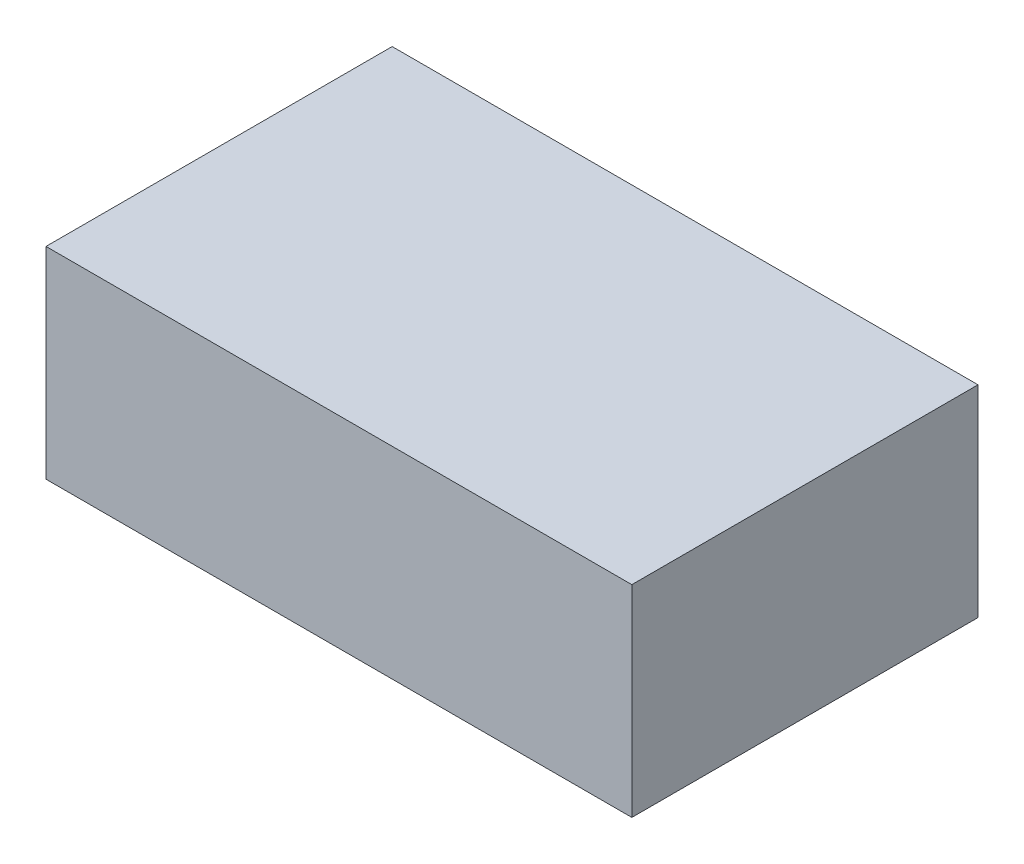
ISO-10303-21;
HEADER;
FILE_DESCRIPTION(('STEP AP214'),'2;1');
FILE_NAME('part.step','',(''),(''),'','','');
FILE_SCHEMA(('AUTOMOTIVE_DESIGN { 1 0 10303 214 1 1 1 1 }'));
ENDSEC;
DATA;
#1=APPLICATION_CONTEXT('core data for automotive mechanical design processes');
#2=APPLICATION_PROTOCOL_DEFINITION('international standard','automotive_design',2000,#1);
#3=PRODUCT_CONTEXT('',#1,'mechanical');
#4=PRODUCT('Part','Part','',(#3));
#5=PRODUCT_RELATED_PRODUCT_CATEGORY('part','',(#4));
#6=PRODUCT_DEFINITION_FORMATION('','',#4);
#7=PRODUCT_DEFINITION_CONTEXT('part definition',#1,'design');
#8=PRODUCT_DEFINITION('design','',#6,#7);
#9=PRODUCT_DEFINITION_SHAPE('','',#8);
#10=(LENGTH_UNIT() NAMED_UNIT(*) SI_UNIT(.MILLI.,.METRE.));
#11=(NAMED_UNIT(*) PLANE_ANGLE_UNIT() SI_UNIT($,.RADIAN.));
#12=(NAMED_UNIT(*) SI_UNIT($,.STERADIAN.) SOLID_ANGLE_UNIT());
#13=UNCERTAINTY_MEASURE_WITH_UNIT(LENGTH_MEASURE(1.E-05),#10,'distance_accuracy_value','');
#14=(GEOMETRIC_REPRESENTATION_CONTEXT(3) GLOBAL_UNCERTAINTY_ASSIGNED_CONTEXT((#13)) GLOBAL_UNIT_ASSIGNED_CONTEXT((#10,
#11,#12)) REPRESENTATION_CONTEXT('',''));
#15=CARTESIAN_POINT('',(0.,0.,0.));
#16=DIRECTION('',(0.,0.,1.));
#17=DIRECTION('',(1.,0.,0.));
#18=AXIS2_PLACEMENT_3D('',#15,#16,#17);
#19=CARTESIAN_POINT('',(77.,53.,45.5));
#20=DIRECTION('',(-1.,0.,0.));
#21=DIRECTION('',(0.,0.,1.));
#22=AXIS2_PLACEMENT_3D('',#19,#20,#21);
#23=PLANE('',#22);
#24=DIRECTION('',(0.,0.,-1.));
#25=VECTOR('',#24,1.);
#26=CARTESIAN_POINT('',(77.,0.,45.5));
#27=LINE('',#26,#25);
#28=CARTESIAN_POINT('',(77.,0.,45.5));
#29=VERTEX_POINT('',#28);
#30=CARTESIAN_POINT('',(77.,0.,-45.5));
#31=VERTEX_POINT('',#30);
#32=EDGE_CURVE('E98',#29,#31,#27,.T.);
#33=ORIENTED_EDGE('',*,*,#32,.T.);
#34=DIRECTION('',(0.,-1.,0.));
#35=VECTOR('',#34,1.);
#36=CARTESIAN_POINT('',(77.,53.,-45.5));
#37=LINE('',#36,#35);
#38=CARTESIAN_POINT('',(77.,53.,-45.5));
#39=VERTEX_POINT('',#38);
#40=EDGE_CURVE('E11',#39,#31,#37,.T.);
#41=ORIENTED_EDGE('',*,*,#40,.F.);
#42=DIRECTION('',(0.,0.,-1.));
#43=VECTOR('',#42,1.);
#44=CARTESIAN_POINT('',(77.,53.,45.5));
#45=LINE('',#44,#43);
#46=CARTESIAN_POINT('',(77.,53.,45.5));
#47=VERTEX_POINT('',#46);
#48=EDGE_CURVE('E86',#47,#39,#45,.T.);
#49=ORIENTED_EDGE('',*,*,#48,.F.);
#50=DIRECTION('',(0.,-1.,0.));
#51=VECTOR('',#50,1.);
#52=CARTESIAN_POINT('',(77.,53.,45.5));
#53=LINE('',#52,#51);
#54=EDGE_CURVE('E94',#47,#29,#53,.T.);
#55=ORIENTED_EDGE('',*,*,#54,.T.);
#56=EDGE_LOOP('',(#33,#41,#49,#55));
#57=FACE_BOUND('',#56,.T.);
#58=ADVANCED_FACE('F35',(#57),#23,.F.);
#59=CARTESIAN_POINT('',(-77.,53.,-45.5));
#60=DIRECTION('',(0.,0.,1.));
#61=DIRECTION('',(1.,0.,0.));
#62=AXIS2_PLACEMENT_3D('',#59,#60,#61);
#63=PLANE('',#62);
#64=DIRECTION('',(-1.,0.,0.));
#65=VECTOR('',#64,1.);
#66=CARTESIAN_POINT('',(-77.,0.,-45.5));
#67=LINE('',#66,#65);
#68=CARTESIAN_POINT('',(-77.,0.,-45.5));
#69=VERTEX_POINT('',#68);
#70=EDGE_CURVE('E90',#31,#69,#67,.T.);
#71=ORIENTED_EDGE('',*,*,#70,.T.);
#72=DIRECTION('',(0.,-1.,0.));
#73=VECTOR('',#72,1.);
#74=CARTESIAN_POINT('',(-77.,53.,-45.5));
#75=LINE('',#74,#73);
#76=CARTESIAN_POINT('',(-77.,53.,-45.5));
#77=VERTEX_POINT('',#76);
#78=EDGE_CURVE('E43',#77,#69,#75,.T.);
#79=ORIENTED_EDGE('',*,*,#78,.F.);
#80=DIRECTION('',(-1.,0.,0.));
#81=VECTOR('',#80,1.);
#82=CARTESIAN_POINT('',(-77.,53.,-45.5));
#83=LINE('',#82,#81);
#84=EDGE_CURVE('E81',#39,#77,#83,.T.);
#85=ORIENTED_EDGE('',*,*,#84,.F.);
#86=ORIENTED_EDGE('',*,*,#40,.T.);
#87=EDGE_LOOP('',(#71,#79,#85,#86));
#88=FACE_BOUND('',#87,.T.);
#89=ADVANCED_FACE('F89',(#88),#63,.F.);
#90=CARTESIAN_POINT('',(-77.,53.,45.5));
#91=DIRECTION('',(1.,0.,0.));
#92=DIRECTION('',(0.,0.,-1.));
#93=AXIS2_PLACEMENT_3D('',#90,#91,#92);
#94=PLANE('',#93);
#95=DIRECTION('',(0.,0.,1.));
#96=VECTOR('',#95,1.);
#97=CARTESIAN_POINT('',(-77.,0.,45.5));
#98=LINE('',#97,#96);
#99=CARTESIAN_POINT('',(-77.,0.,45.5));
#100=VERTEX_POINT('',#99);
#101=EDGE_CURVE('E68',#69,#100,#98,.T.);
#102=ORIENTED_EDGE('',*,*,#101,.T.);
#103=DIRECTION('',(0.,-1.,0.));
#104=VECTOR('',#103,1.);
#105=CARTESIAN_POINT('',(-77.,53.,45.5));
#106=LINE('',#105,#104);
#107=CARTESIAN_POINT('',(-77.,53.,45.5));
#108=VERTEX_POINT('',#107);
#109=EDGE_CURVE('E91',#108,#100,#106,.T.);
#110=ORIENTED_EDGE('',*,*,#109,.F.);
#111=DIRECTION('',(0.,0.,1.));
#112=VECTOR('',#111,1.);
#113=CARTESIAN_POINT('',(-77.,53.,45.5));
#114=LINE('',#113,#112);
#115=EDGE_CURVE('E84',#77,#108,#114,.T.);
#116=ORIENTED_EDGE('',*,*,#115,.F.);
#117=ORIENTED_EDGE('',*,*,#78,.T.);
#118=EDGE_LOOP('',(#102,#110,#116,#117));
#119=FACE_BOUND('',#118,.T.);
#120=ADVANCED_FACE('F92',(#119),#94,.F.);
#121=CARTESIAN_POINT('',(-77.,53.,45.5));
#122=DIRECTION('',(0.,0.,-1.));
#123=DIRECTION('',(-1.,0.,0.));
#124=AXIS2_PLACEMENT_3D('',#121,#122,#123);
#125=PLANE('',#124);
#126=DIRECTION('',(1.,0.,0.));
#127=VECTOR('',#126,1.);
#128=CARTESIAN_POINT('',(-77.,0.,45.5));
#129=LINE('',#128,#127);
#130=EDGE_CURVE('E74',#100,#29,#129,.T.);
#131=ORIENTED_EDGE('',*,*,#130,.T.);
#132=ORIENTED_EDGE('',*,*,#54,.F.);
#133=DIRECTION('',(1.,0.,0.));
#134=VECTOR('',#133,1.);
#135=CARTESIAN_POINT('',(-77.,53.,45.5));
#136=LINE('',#135,#134);
#137=EDGE_CURVE('E51',#108,#47,#136,.T.);
#138=ORIENTED_EDGE('',*,*,#137,.F.);
#139=ORIENTED_EDGE('',*,*,#109,.T.);
#140=EDGE_LOOP('',(#131,#132,#138,#139));
#141=FACE_BOUND('',#140,.T.);
#142=ADVANCED_FACE('F105',(#141),#125,.F.);
#143=CARTESIAN_POINT('',(0.,53.,0.));
#144=DIRECTION('',(0.,-1.,0.));
#145=DIRECTION('',(0.,0.,-1.));
#146=AXIS2_PLACEMENT_3D('',#143,#144,#145);
#147=PLANE('',#146);
#148=ORIENTED_EDGE('',*,*,#48,.T.);
#149=ORIENTED_EDGE('',*,*,#84,.T.);
#150=ORIENTED_EDGE('',*,*,#115,.T.);
#151=ORIENTED_EDGE('',*,*,#137,.T.);
#152=EDGE_LOOP('',(#148,#149,#150,#151));
#153=FACE_BOUND('',#152,.T.);
#154=ADVANCED_FACE('F82',(#153),#147,.F.);
#155=CARTESIAN_POINT('',(0.,0.,0.));
#156=DIRECTION('',(0.,-1.,0.));
#157=DIRECTION('',(0.,0.,-1.));
#158=AXIS2_PLACEMENT_3D('',#155,#156,#157);
#159=PLANE('',#158);
#160=ORIENTED_EDGE('',*,*,#32,.F.);
#161=ORIENTED_EDGE('',*,*,#130,.F.);
#162=ORIENTED_EDGE('',*,*,#101,.F.);
#163=ORIENTED_EDGE('',*,*,#70,.F.);
#164=EDGE_LOOP('',(#160,#161,#162,#163));
#165=FACE_BOUND('',#164,.T.);
#166=ADVANCED_FACE('F108',(#165),#159,.T.);
#167=CLOSED_SHELL('',(#58,#89,#120,#142,#154,#166));
#168=MANIFOLD_SOLID_BREP('B2',#167);
#169=ADVANCED_BREP_SHAPE_REPRESENTATION('',(#18,#168),#14);
#170=SHAPE_DEFINITION_REPRESENTATION(#9,#169);
ENDSEC;
END-ISO-10303-21;
